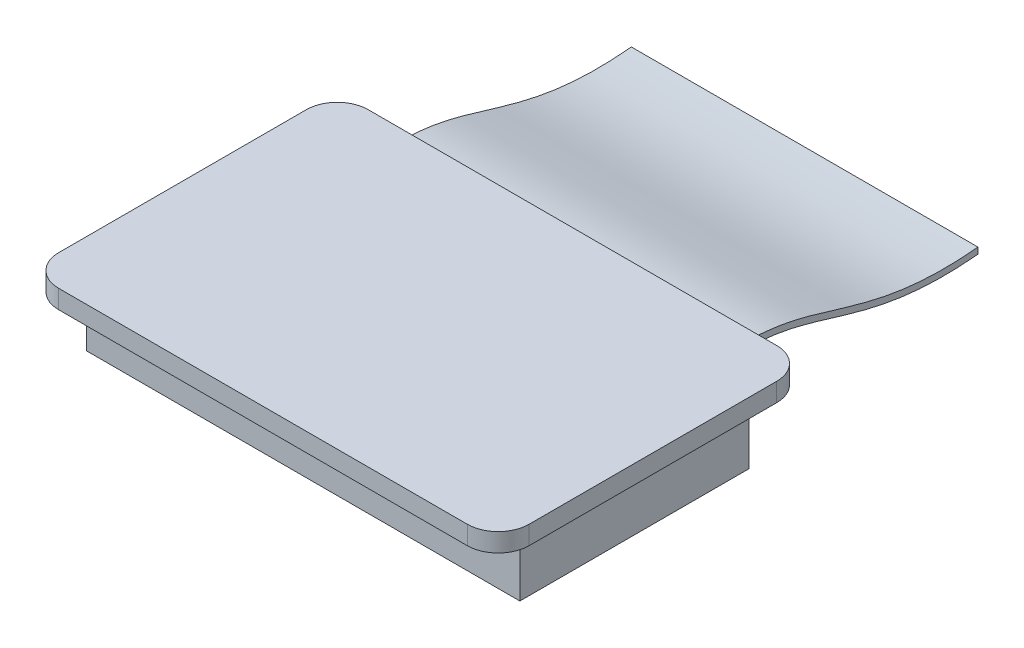
ISO-10303-21;
HEADER;
FILE_DESCRIPTION(('STEP AP214'),'2;1');
FILE_NAME('part.step','',(''),(''),'','','');
FILE_SCHEMA(('AUTOMOTIVE_DESIGN { 1 0 10303 214 1 1 1 1 }'));
ENDSEC;
DATA;
#1=APPLICATION_CONTEXT('core data for automotive mechanical design processes');
#2=APPLICATION_PROTOCOL_DEFINITION('international standard','automotive_design',2000,#1);
#3=PRODUCT_CONTEXT('',#1,'mechanical');
#4=PRODUCT('Part','Part','',(#3));
#5=PRODUCT_RELATED_PRODUCT_CATEGORY('part','',(#4));
#6=PRODUCT_DEFINITION_FORMATION('','',#4);
#7=PRODUCT_DEFINITION_CONTEXT('part definition',#1,'design');
#8=PRODUCT_DEFINITION('design','',#6,#7);
#9=PRODUCT_DEFINITION_SHAPE('','',#8);
#10=(LENGTH_UNIT() NAMED_UNIT(*) SI_UNIT(.MILLI.,.METRE.));
#11=(NAMED_UNIT(*) PLANE_ANGLE_UNIT() SI_UNIT($,.RADIAN.));
#12=(NAMED_UNIT(*) SI_UNIT($,.STERADIAN.) SOLID_ANGLE_UNIT());
#13=UNCERTAINTY_MEASURE_WITH_UNIT(LENGTH_MEASURE(1.E-05),#10,'distance_accuracy_value','');
#14=(GEOMETRIC_REPRESENTATION_CONTEXT(3) GLOBAL_UNCERTAINTY_ASSIGNED_CONTEXT((#13)) GLOBAL_UNIT_ASSIGNED_CONTEXT((#10,
#11,#12)) REPRESENTATION_CONTEXT('',''));
#15=CARTESIAN_POINT('',(0.,0.,0.));
#16=DIRECTION('',(0.,0.,1.));
#17=DIRECTION('',(1.,0.,0.));
#18=AXIS2_PLACEMENT_3D('',#15,#16,#17);
#19=CARTESIAN_POINT('',(3.3,0.748301222298696,8.25169585037883));
#20=DIRECTION('',(0.,-1.,0.));
#21=DIRECTION('',(0.,0.,-1.));
#22=AXIS2_PLACEMENT_3D('',#19,#20,#21);
#23=CYLINDRICAL_SURFACE('',#22,0.5);
#24=CARTESIAN_POINT('',(3.3,0.448301222298696,8.25169585037883));
#25=DIRECTION('',(0.,-1.,0.));
#26=DIRECTION('',(0.,0.,-1.));
#27=AXIS2_PLACEMENT_3D('',#24,#25,#26);
#28=CIRCLE('',#27,0.5);
#29=CARTESIAN_POINT('',(3.3,0.448301222298696,7.75169585037883));
#30=VERTEX_POINT('',#29);
#31=CARTESIAN_POINT('',(3.8,0.448301222298696,8.25169585037883));
#32=VERTEX_POINT('',#31);
#33=EDGE_CURVE('E176',#30,#32,#28,.T.);
#34=ORIENTED_EDGE('',*,*,#33,.F.);
#35=DIRECTION('',(0.,-1.,0.));
#36=VECTOR('',#35,1.);
#37=CARTESIAN_POINT('',(3.3,0.748301222298696,7.75169585037883));
#38=LINE('',#37,#36);
#39=CARTESIAN_POINT('',(3.3,0.748301222298696,7.75169585037883));
#40=VERTEX_POINT('',#39);
#41=EDGE_CURVE('E13',#40,#30,#38,.T.);
#42=ORIENTED_EDGE('',*,*,#41,.F.);
#43=CARTESIAN_POINT('',(3.3,0.748301222298696,8.25169585037883));
#44=DIRECTION('',(0.,-1.,0.));
#45=DIRECTION('',(0.,0.,-1.));
#46=AXIS2_PLACEMENT_3D('',#43,#44,#45);
#47=CIRCLE('',#46,0.5);
#48=CARTESIAN_POINT('',(3.8,0.748301222298696,8.25169585037883));
#49=VERTEX_POINT('',#48);
#50=EDGE_CURVE('E197',#40,#49,#47,.T.);
#51=ORIENTED_EDGE('',*,*,#50,.T.);
#52=DIRECTION('',(0.,-1.,0.));
#53=VECTOR('',#52,1.);
#54=CARTESIAN_POINT('',(3.8,0.748301222298696,8.25169585037883));
#55=LINE('',#54,#53);
#56=EDGE_CURVE('E69',#49,#32,#55,.T.);
#57=ORIENTED_EDGE('',*,*,#56,.T.);
#58=EDGE_LOOP('',(#34,#42,#51,#57));
#59=FACE_BOUND('',#58,.T.);
#60=ADVANCED_FACE('F66',(#59),#23,.T.);
#61=CARTESIAN_POINT('',(-3.3,0.748301222298696,7.75169585037883));
#62=DIRECTION('',(0.,0.,-1.));
#63=DIRECTION('',(-1.,0.,0.));
#64=AXIS2_PLACEMENT_3D('',#61,#62,#63);
#65=PLANE('',#64);
#66=DIRECTION('',(1.,0.,0.));
#67=VECTOR('',#66,1.);
#68=CARTESIAN_POINT('',(-3.3,0.448301222298696,7.75169585037883));
#69=LINE('',#68,#67);
#70=CARTESIAN_POINT('',(-3.3,0.448301222298696,7.75169585037883));
#71=VERTEX_POINT('',#70);
#72=EDGE_CURVE('E195',#71,#30,#69,.T.);
#73=ORIENTED_EDGE('',*,*,#72,.F.);
#74=DIRECTION('',(0.,-1.,0.));
#75=VECTOR('',#74,1.);
#76=CARTESIAN_POINT('',(-3.3,0.748301222298696,7.75169585037883));
#77=LINE('',#76,#75);
#78=CARTESIAN_POINT('',(-3.3,0.748301222298696,7.75169585037883));
#79=VERTEX_POINT('',#78);
#80=EDGE_CURVE('E74',#79,#71,#77,.T.);
#81=ORIENTED_EDGE('',*,*,#80,.F.);
#82=DIRECTION('',(1.,0.,0.));
#83=VECTOR('',#82,1.);
#84=CARTESIAN_POINT('',(-3.3,0.748301222298696,7.75169585037883));
#85=LINE('',#84,#83);
#86=EDGE_CURVE('E166',#79,#40,#85,.T.);
#87=ORIENTED_EDGE('',*,*,#86,.T.);
#88=ORIENTED_EDGE('',*,*,#41,.T.);
#89=EDGE_LOOP('',(#73,#81,#87,#88));
#90=FACE_BOUND('',#89,.T.);
#91=ADVANCED_FACE('F209',(#90),#65,.T.);
#92=CARTESIAN_POINT('',(-3.3,0.748301222298696,8.25169585037883));
#93=DIRECTION('',(0.,-1.,0.));
#94=DIRECTION('',(0.,0.,-1.));
#95=AXIS2_PLACEMENT_3D('',#92,#93,#94);
#96=CYLINDRICAL_SURFACE('',#95,0.5);
#97=CARTESIAN_POINT('',(-3.3,0.448301222298696,8.25169585037883));
#98=DIRECTION('',(0.,-1.,0.));
#99=DIRECTION('',(0.,0.,-1.));
#100=AXIS2_PLACEMENT_3D('',#97,#98,#99);
#101=CIRCLE('',#100,0.5);
#102=CARTESIAN_POINT('',(-3.8,0.448301222298696,8.25169585037883));
#103=VERTEX_POINT('',#102);
#104=EDGE_CURVE('E153',#103,#71,#101,.T.);
#105=ORIENTED_EDGE('',*,*,#104,.F.);
#106=DIRECTION('',(0.,-1.,0.));
#107=VECTOR('',#106,1.);
#108=CARTESIAN_POINT('',(-3.8,0.748301222298696,8.25169585037883));
#109=LINE('',#108,#107);
#110=CARTESIAN_POINT('',(-3.8,0.748301222298696,8.25169585037883));
#111=VERTEX_POINT('',#110);
#112=EDGE_CURVE('E147',#111,#103,#109,.T.);
#113=ORIENTED_EDGE('',*,*,#112,.F.);
#114=CARTESIAN_POINT('',(-3.3,0.748301222298696,8.25169585037883));
#115=DIRECTION('',(0.,-1.,0.));
#116=DIRECTION('',(0.,0.,-1.));
#117=AXIS2_PLACEMENT_3D('',#114,#115,#116);
#118=CIRCLE('',#117,0.5);
#119=EDGE_CURVE('E150',#111,#79,#118,.T.);
#120=ORIENTED_EDGE('',*,*,#119,.T.);
#121=ORIENTED_EDGE('',*,*,#80,.T.);
#122=EDGE_LOOP('',(#105,#113,#120,#121));
#123=FACE_BOUND('',#122,.T.);
#124=ADVANCED_FACE('F149',(#123),#96,.T.);
#125=CARTESIAN_POINT('',(-3.8,0.748301222298696,12.2516958503788));
#126=DIRECTION('',(-1.,0.,0.));
#127=DIRECTION('',(0.,0.,1.));
#128=AXIS2_PLACEMENT_3D('',#125,#126,#127);
#129=PLANE('',#128);
#130=DIRECTION('',(0.,0.,-1.));
#131=VECTOR('',#130,1.);
#132=CARTESIAN_POINT('',(-3.8,0.448301222298696,12.2516958503788));
#133=LINE('',#132,#131);
#134=CARTESIAN_POINT('',(-3.8,0.448301222298696,12.2516958503788));
#135=VERTEX_POINT('',#134);
#136=EDGE_CURVE('E192',#135,#103,#133,.T.);
#137=ORIENTED_EDGE('',*,*,#136,.F.);
#138=DIRECTION('',(0.,-1.,0.));
#139=VECTOR('',#138,1.);
#140=CARTESIAN_POINT('',(-3.8,0.748301222298696,12.2516958503788));
#141=LINE('',#140,#139);
#142=CARTESIAN_POINT('',(-3.8,0.748301222298696,12.2516958503788));
#143=VERTEX_POINT('',#142);
#144=EDGE_CURVE('E158',#143,#135,#141,.T.);
#145=ORIENTED_EDGE('',*,*,#144,.F.);
#146=DIRECTION('',(0.,0.,-1.));
#147=VECTOR('',#146,1.);
#148=CARTESIAN_POINT('',(-3.8,0.748301222298696,12.2516958503788));
#149=LINE('',#148,#147);
#150=EDGE_CURVE('E164',#143,#111,#149,.T.);
#151=ORIENTED_EDGE('',*,*,#150,.T.);
#152=ORIENTED_EDGE('',*,*,#112,.T.);
#153=EDGE_LOOP('',(#137,#145,#151,#152));
#154=FACE_BOUND('',#153,.T.);
#155=ADVANCED_FACE('F168',(#154),#129,.T.);
#156=CARTESIAN_POINT('',(-3.3,0.748301222298696,12.2516958503788));
#157=DIRECTION('',(0.,-1.,0.));
#158=DIRECTION('',(0.,0.,-1.));
#159=AXIS2_PLACEMENT_3D('',#156,#157,#158);
#160=CYLINDRICAL_SURFACE('',#159,0.5);
#161=CARTESIAN_POINT('',(-3.3,0.448301222298696,12.2516958503788));
#162=DIRECTION('',(0.,-1.,0.));
#163=DIRECTION('',(0.,0.,-1.));
#164=AXIS2_PLACEMENT_3D('',#161,#162,#163);
#165=CIRCLE('',#164,0.5);
#166=CARTESIAN_POINT('',(-3.3,0.448301222298696,12.7516958503788));
#167=VERTEX_POINT('',#166);
#168=EDGE_CURVE('E189',#167,#135,#165,.T.);
#169=ORIENTED_EDGE('',*,*,#168,.F.);
#170=DIRECTION('',(0.,-1.,0.));
#171=VECTOR('',#170,1.);
#172=CARTESIAN_POINT('',(-3.3,0.748301222298696,12.7516958503788));
#173=LINE('',#172,#171);
#174=CARTESIAN_POINT('',(-3.3,0.748301222298696,12.7516958503788));
#175=VERTEX_POINT('',#174);
#176=EDGE_CURVE('E201',#175,#167,#173,.T.);
#177=ORIENTED_EDGE('',*,*,#176,.F.);
#178=CARTESIAN_POINT('',(-3.3,0.748301222298696,12.2516958503788));
#179=DIRECTION('',(0.,-1.,0.));
#180=DIRECTION('',(0.,0.,-1.));
#181=AXIS2_PLACEMENT_3D('',#178,#179,#180);
#182=CIRCLE('',#181,0.5);
#183=EDGE_CURVE('E169',#175,#143,#182,.T.);
#184=ORIENTED_EDGE('',*,*,#183,.T.);
#185=ORIENTED_EDGE('',*,*,#144,.T.);
#186=EDGE_LOOP('',(#169,#177,#184,#185));
#187=FACE_BOUND('',#186,.T.);
#188=ADVANCED_FACE('F222',(#187),#160,.T.);
#189=CARTESIAN_POINT('',(-3.3,0.748301222298696,12.7516958503788));
#190=DIRECTION('',(0.,0.,1.));
#191=DIRECTION('',(1.,0.,0.));
#192=AXIS2_PLACEMENT_3D('',#189,#190,#191);
#193=PLANE('',#192);
#194=DIRECTION('',(-1.,0.,0.));
#195=VECTOR('',#194,1.);
#196=CARTESIAN_POINT('',(-3.3,0.448301222298696,12.7516958503788));
#197=LINE('',#196,#195);
#198=CARTESIAN_POINT('',(3.3,0.448301222298696,12.7516958503788));
#199=VERTEX_POINT('',#198);
#200=EDGE_CURVE('E186',#199,#167,#197,.T.);
#201=ORIENTED_EDGE('',*,*,#200,.F.);
#202=DIRECTION('',(0.,-1.,0.));
#203=VECTOR('',#202,1.);
#204=CARTESIAN_POINT('',(3.3,0.748301222298696,12.7516958503788));
#205=LINE('',#204,#203);
#206=CARTESIAN_POINT('',(3.3,0.748301222298696,12.7516958503788));
#207=VERTEX_POINT('',#206);
#208=EDGE_CURVE('E203',#207,#199,#205,.T.);
#209=ORIENTED_EDGE('',*,*,#208,.F.);
#210=DIRECTION('',(-1.,0.,0.));
#211=VECTOR('',#210,1.);
#212=CARTESIAN_POINT('',(-3.3,0.748301222298696,12.7516958503788));
#213=LINE('',#212,#211);
#214=EDGE_CURVE('E171',#207,#175,#213,.T.);
#215=ORIENTED_EDGE('',*,*,#214,.T.);
#216=ORIENTED_EDGE('',*,*,#176,.T.);
#217=EDGE_LOOP('',(#201,#209,#215,#216));
#218=FACE_BOUND('',#217,.T.);
#219=ADVANCED_FACE('F225',(#218),#193,.T.);
#220=CARTESIAN_POINT('',(3.3,0.748301222298696,12.2516958503788));
#221=DIRECTION('',(0.,-1.,0.));
#222=DIRECTION('',(0.,0.,-1.));
#223=AXIS2_PLACEMENT_3D('',#220,#221,#222);
#224=CYLINDRICAL_SURFACE('',#223,0.5);
#225=CARTESIAN_POINT('',(3.3,0.448301222298696,12.2516958503788));
#226=DIRECTION('',(0.,-1.,0.));
#227=DIRECTION('',(0.,0.,1.));
#228=AXIS2_PLACEMENT_3D('',#225,#226,#227);
#229=CIRCLE('',#228,0.5);
#230=CARTESIAN_POINT('',(3.8,0.448301222298696,12.2516958503788));
#231=VERTEX_POINT('',#230);
#232=EDGE_CURVE('E183',#231,#199,#229,.T.);
#233=ORIENTED_EDGE('',*,*,#232,.F.);
#234=DIRECTION('',(0.,-1.,0.));
#235=VECTOR('',#234,1.);
#236=CARTESIAN_POINT('',(3.8,0.748301222298696,12.2516958503788));
#237=LINE('',#236,#235);
#238=CARTESIAN_POINT('',(3.8,0.748301222298696,12.2516958503788));
#239=VERTEX_POINT('',#238);
#240=EDGE_CURVE('E204',#239,#231,#237,.T.);
#241=ORIENTED_EDGE('',*,*,#240,.F.);
#242=CARTESIAN_POINT('',(3.3,0.748301222298696,12.2516958503788));
#243=DIRECTION('',(0.,-1.,0.));
#244=DIRECTION('',(0.,0.,1.));
#245=AXIS2_PLACEMENT_3D('',#242,#243,#244);
#246=CIRCLE('',#245,0.5);
#247=EDGE_CURVE('E293',#239,#207,#246,.T.);
#248=ORIENTED_EDGE('',*,*,#247,.T.);
#249=ORIENTED_EDGE('',*,*,#208,.T.);
#250=EDGE_LOOP('',(#233,#241,#248,#249));
#251=FACE_BOUND('',#250,.T.);
#252=ADVANCED_FACE('F229',(#251),#224,.T.);
#253=CARTESIAN_POINT('',(3.8,0.748301222298696,12.2516958503788));
#254=DIRECTION('',(1.,0.,0.));
#255=DIRECTION('',(0.,0.,-1.));
#256=AXIS2_PLACEMENT_3D('',#253,#254,#255);
#257=PLANE('',#256);
#258=DIRECTION('',(0.,0.,1.));
#259=VECTOR('',#258,1.);
#260=CARTESIAN_POINT('',(3.8,0.448301222298696,12.2516958503788));
#261=LINE('',#260,#259);
#262=EDGE_CURVE('E179',#32,#231,#261,.T.);
#263=ORIENTED_EDGE('',*,*,#262,.F.);
#264=ORIENTED_EDGE('',*,*,#56,.F.);
#265=DIRECTION('',(0.,0.,1.));
#266=VECTOR('',#265,1.);
#267=CARTESIAN_POINT('',(3.8,0.748301222298696,12.2516958503788));
#268=LINE('',#267,#266);
#269=EDGE_CURVE('E291',#49,#239,#268,.T.);
#270=ORIENTED_EDGE('',*,*,#269,.T.);
#271=ORIENTED_EDGE('',*,*,#240,.T.);
#272=EDGE_LOOP('',(#263,#264,#270,#271));
#273=FACE_BOUND('',#272,.T.);
#274=ADVANCED_FACE('F206',(#273),#257,.T.);
#275=CARTESIAN_POINT('',(3.3,0.748301222298696,8.25169585037883));
#276=DIRECTION('',(0.,-1.,0.));
#277=DIRECTION('',(0.,0.,-1.));
#278=AXIS2_PLACEMENT_3D('',#275,#276,#277);
#279=PLANE('',#278);
#280=ORIENTED_EDGE('',*,*,#50,.F.);
#281=ORIENTED_EDGE('',*,*,#86,.F.);
#282=ORIENTED_EDGE('',*,*,#119,.F.);
#283=ORIENTED_EDGE('',*,*,#150,.F.);
#284=ORIENTED_EDGE('',*,*,#183,.F.);
#285=ORIENTED_EDGE('',*,*,#214,.F.);
#286=ORIENTED_EDGE('',*,*,#247,.F.);
#287=ORIENTED_EDGE('',*,*,#269,.F.);
#288=EDGE_LOOP('',(#280,#281,#282,#283,#284,#285,#286,#287));
#289=FACE_BOUND('',#288,.T.);
#290=ADVANCED_FACE('F162',(#289),#279,.F.);
#291=CARTESIAN_POINT('',(3.3,0.448301222298696,8.25169585037883));
#292=DIRECTION('',(0.,-1.,0.));
#293=DIRECTION('',(0.,0.,-1.));
#294=AXIS2_PLACEMENT_3D('',#291,#292,#293);
#295=PLANE('',#294);
#296=DIRECTION('',(0.,0.,1.));
#297=VECTOR('',#296,1.);
#298=CARTESIAN_POINT('',(3.5,0.448301222298696,12.1016958503788));
#299=LINE('',#298,#297);
#300=CARTESIAN_POINT('',(3.5,0.448301222298696,8.40169585037883));
#301=VERTEX_POINT('',#300);
#302=CARTESIAN_POINT('',(3.5,0.448301222298696,12.1016958503788));
#303=VERTEX_POINT('',#302);
#304=EDGE_CURVE('E275',#301,#303,#299,.T.);
#305=ORIENTED_EDGE('',*,*,#304,.F.);
#306=DIRECTION('',(-1.,0.,0.));
#307=VECTOR('',#306,1.);
#308=CARTESIAN_POINT('',(3.5,0.448301222298696,8.40169585037883));
#309=LINE('',#308,#307);
#310=CARTESIAN_POINT('',(-3.5,0.448301222298696,8.40169585037883));
#311=VERTEX_POINT('',#310);
#312=EDGE_CURVE('E286',#301,#311,#309,.T.);
#313=ORIENTED_EDGE('',*,*,#312,.T.);
#314=DIRECTION('',(0.,0.,1.));
#315=VECTOR('',#314,1.);
#316=CARTESIAN_POINT('',(-3.5,0.448301222298696,12.1016958503788));
#317=LINE('',#316,#315);
#318=CARTESIAN_POINT('',(-3.5,0.448301222298696,12.1016958503788));
#319=VERTEX_POINT('',#318);
#320=EDGE_CURVE('E278',#311,#319,#317,.T.);
#321=ORIENTED_EDGE('',*,*,#320,.T.);
#322=DIRECTION('',(-1.,0.,0.));
#323=VECTOR('',#322,1.);
#324=CARTESIAN_POINT('',(3.5,0.448301222298696,12.1016958503788));
#325=LINE('',#324,#323);
#326=EDGE_CURVE('E302',#303,#319,#325,.T.);
#327=ORIENTED_EDGE('',*,*,#326,.F.);
#328=EDGE_LOOP('',(#305,#313,#321,#327));
#329=FACE_BOUND('',#328,.T.);
#330=ORIENTED_EDGE('',*,*,#33,.T.);
#331=ORIENTED_EDGE('',*,*,#262,.T.);
#332=ORIENTED_EDGE('',*,*,#232,.T.);
#333=ORIENTED_EDGE('',*,*,#200,.T.);
#334=ORIENTED_EDGE('',*,*,#168,.T.);
#335=ORIENTED_EDGE('',*,*,#136,.T.);
#336=ORIENTED_EDGE('',*,*,#104,.T.);
#337=ORIENTED_EDGE('',*,*,#72,.T.);
#338=EDGE_LOOP('',(#330,#331,#332,#333,#334,#335,#336,#337));
#339=FACE_BOUND('',#338,.T.);
#340=ADVANCED_FACE('F208',(#329,#339),#295,.T.);
#341=CARTESIAN_POINT('',(3.5,0.448301222298696,12.1016958503788));
#342=DIRECTION('',(0.,0.,-1.));
#343=DIRECTION('',(-1.,0.,0.));
#344=AXIS2_PLACEMENT_3D('',#341,#342,#343);
#345=PLANE('',#344);
#346=DIRECTION('',(0.,-1.,0.));
#347=VECTOR('',#346,1.);
#348=CARTESIAN_POINT('',(-3.5,0.448301222298696,12.1016958503788));
#349=LINE('',#348,#347);
#350=CARTESIAN_POINT('',(-3.5,-0.551698777701304,12.1016958503788));
#351=VERTEX_POINT('',#350);
#352=EDGE_CURVE('E82',#319,#351,#349,.T.);
#353=ORIENTED_EDGE('',*,*,#352,.T.);
#354=DIRECTION('',(-1.,0.,0.));
#355=VECTOR('',#354,1.);
#356=CARTESIAN_POINT('',(3.5,-0.551698777701304,12.1016958503788));
#357=LINE('',#356,#355);
#358=CARTESIAN_POINT('',(3.5,-0.551698777701304,12.1016958503788));
#359=VERTEX_POINT('',#358);
#360=EDGE_CURVE('E180',#359,#351,#357,.T.);
#361=ORIENTED_EDGE('',*,*,#360,.F.);
#362=DIRECTION('',(0.,-1.,0.));
#363=VECTOR('',#362,1.);
#364=CARTESIAN_POINT('',(3.5,0.448301222298696,12.1016958503788));
#365=LINE('',#364,#363);
#366=EDGE_CURVE('E267',#303,#359,#365,.T.);
#367=ORIENTED_EDGE('',*,*,#366,.F.);
#368=ORIENTED_EDGE('',*,*,#326,.T.);
#369=EDGE_LOOP('',(#353,#361,#367,#368));
#370=FACE_BOUND('',#369,.T.);
#371=ADVANCED_FACE('F240',(#370),#345,.F.);
#372=CARTESIAN_POINT('',(3.5,-0.551698777701304,12.1016958503788));
#373=DIRECTION('',(0.,1.,0.));
#374=DIRECTION('',(0.,0.,1.));
#375=AXIS2_PLACEMENT_3D('',#372,#373,#374);
#376=PLANE('',#375);
#377=DIRECTION('',(0.,0.,-1.));
#378=VECTOR('',#377,1.);
#379=CARTESIAN_POINT('',(-3.5,-0.551698777701304,12.1016958503788));
#380=LINE('',#379,#378);
#381=CARTESIAN_POINT('',(-3.5,-0.551698777701304,8.40169585037883));
#382=VERTEX_POINT('',#381);
#383=EDGE_CURVE('E309',#351,#382,#380,.T.);
#384=ORIENTED_EDGE('',*,*,#383,.T.);
#385=DIRECTION('',(-1.,0.,0.));
#386=VECTOR('',#385,1.);
#387=CARTESIAN_POINT('',(3.5,-0.551698777701304,8.40169585037883));
#388=LINE('',#387,#386);
#389=CARTESIAN_POINT('',(3.5,-0.551698777701304,8.40169585037883));
#390=VERTEX_POINT('',#389);
#391=EDGE_CURVE('E283',#390,#382,#388,.T.);
#392=ORIENTED_EDGE('',*,*,#391,.F.);
#393=DIRECTION('',(0.,0.,-1.));
#394=VECTOR('',#393,1.);
#395=CARTESIAN_POINT('',(3.5,-0.551698777701304,12.1016958503788));
#396=LINE('',#395,#394);
#397=EDGE_CURVE('E272',#359,#390,#396,.T.);
#398=ORIENTED_EDGE('',*,*,#397,.F.);
#399=ORIENTED_EDGE('',*,*,#360,.T.);
#400=EDGE_LOOP('',(#384,#392,#398,#399));
#401=FACE_BOUND('',#400,.T.);
#402=ADVANCED_FACE('F245',(#401),#376,.F.);
#403=CARTESIAN_POINT('',(3.5,0.448301222298696,8.40169585037883));
#404=DIRECTION('',(0.,0.,1.));
#405=DIRECTION('',(1.,0.,0.));
#406=AXIS2_PLACEMENT_3D('',#403,#404,#405);
#407=PLANE('',#406);
#408=DIRECTION('',(0.,1.,0.));
#409=VECTOR('',#408,1.);
#410=CARTESIAN_POINT('',(-3.5,0.448301222298696,8.40169585037883));
#411=LINE('',#410,#409);
#412=EDGE_CURVE('E306',#382,#311,#411,.T.);
#413=ORIENTED_EDGE('',*,*,#412,.T.);
#414=ORIENTED_EDGE('',*,*,#312,.F.);
#415=DIRECTION('',(0.,1.,0.));
#416=VECTOR('',#415,1.);
#417=CARTESIAN_POINT('',(3.5,0.448301222298696,8.40169585037883));
#418=LINE('',#417,#416);
#419=EDGE_CURVE('E313',#390,#301,#418,.T.);
#420=ORIENTED_EDGE('',*,*,#419,.F.);
#421=ORIENTED_EDGE('',*,*,#391,.T.);
#422=EDGE_LOOP('',(#413,#414,#420,#421));
#423=FACE_BOUND('',#422,.T.);
#424=ADVANCED_FACE('F249',(#423),#407,.F.);
#425=CARTESIAN_POINT('',(3.5,0.,0.));
#426=DIRECTION('',(1.,0.,0.));
#427=DIRECTION('',(0.,0.,-1.));
#428=AXIS2_PLACEMENT_3D('',#425,#426,#427);
#429=PLANE('',#428);
#430=ORIENTED_EDGE('',*,*,#366,.T.);
#431=ORIENTED_EDGE('',*,*,#397,.T.);
#432=ORIENTED_EDGE('',*,*,#419,.T.);
#433=ORIENTED_EDGE('',*,*,#304,.T.);
#434=EDGE_LOOP('',(#430,#431,#432,#433));
#435=FACE_BOUND('',#434,.T.);
#436=ADVANCED_FACE('F253',(#435),#429,.T.);
#437=CARTESIAN_POINT('',(-3.5,0.,0.));
#438=DIRECTION('',(1.,0.,0.));
#439=DIRECTION('',(0.,0.,-1.));
#440=AXIS2_PLACEMENT_3D('',#437,#438,#439);
#441=PLANE('',#440);
#442=ORIENTED_EDGE('',*,*,#352,.F.);
#443=ORIENTED_EDGE('',*,*,#320,.F.);
#444=ORIENTED_EDGE('',*,*,#412,.F.);
#445=ORIENTED_EDGE('',*,*,#383,.F.);
#446=EDGE_LOOP('',(#442,#443,#444,#445));
#447=FACE_BOUND('',#446,.T.);
#448=ADVANCED_FACE('F255',(#447),#441,.F.);
#449=CLOSED_SHELL('',(#60,#91,#124,#155,#188,#219,#252,#274,#290,#340,#371,#402,#424,#436,#448));
#450=MANIFOLD_SOLID_BREP('B2',#449);
#451=CARTESIAN_POINT('',(0.,0.547843022465263,7.7421339457778));
#452=DIRECTION('',(0.,0.0956190460103406,0.995418001665669));
#453=DIRECTION('',(1.,0.,0.));
#454=AXIS2_PLACEMENT_3D('',#451,#452,#453);
#455=PLANE('',#454);
#456=DIRECTION('',(0.,-0.995418001665668,0.0956190460103406));
#457=VECTOR('',#456,1.);
#458=CARTESIAN_POINT('',(-2.8,0.547843022465263,7.7421339457778));
#459=LINE('',#458,#457);
#460=CARTESIAN_POINT('',(-2.8,0.547843022465263,7.7421339457778));
#461=VERTEX_POINT('',#460);
#462=CARTESIAN_POINT('',(-2.8,0.448301222298696,7.75169585037883));
#463=VERTEX_POINT('',#462);
#464=EDGE_CURVE('E457',#461,#463,#459,.T.);
#465=ORIENTED_EDGE('',*,*,#464,.T.);
#466=DIRECTION('',(1.,0.,0.));
#467=VECTOR('',#466,1.);
#468=CARTESIAN_POINT('',(-2.8,0.448301222298696,7.75169585037883));
#469=LINE('',#468,#467);
#470=CARTESIAN_POINT('',(2.8,0.448301222298696,7.75169585037883));
#471=VERTEX_POINT('',#470);
#472=EDGE_CURVE('E463',#463,#471,#469,.T.);
#473=ORIENTED_EDGE('',*,*,#472,.T.);
#474=DIRECTION('',(0.,0.995418001665668,-0.0956190460103407));
#475=VECTOR('',#474,1.);
#476=CARTESIAN_POINT('',(2.8,0.547843022465264,7.7421339457778));
#477=LINE('',#476,#475);
#478=CARTESIAN_POINT('',(2.8,0.547843022465264,7.7421339457778));
#479=VERTEX_POINT('',#478);
#480=EDGE_CURVE('E458',#471,#479,#477,.T.);
#481=ORIENTED_EDGE('',*,*,#480,.T.);
#482=DIRECTION('',(-1.,0.,0.));
#483=VECTOR('',#482,1.);
#484=CARTESIAN_POINT('',(-2.8,0.547843022465263,7.7421339457778));
#485=LINE('',#484,#483);
#486=EDGE_CURVE('E418',#479,#461,#485,.T.);
#487=ORIENTED_EDGE('',*,*,#486,.T.);
#488=EDGE_LOOP('',(#465,#473,#481,#487));
#489=FACE_BOUND('',#488,.T.);
#490=ADVANCED_FACE('F414',(#489),#455,.T.);
#491=CARTESIAN_POINT('',(0.,0.,3.99999999999998));
#492=DIRECTION('',(0.,0.,1.));
#493=DIRECTION('',(1.,0.,0.));
#494=AXIS2_PLACEMENT_3D('',#491,#492,#493);
#495=PLANE('',#494);
#496=DIRECTION('',(0.,-1.,0.));
#497=VECTOR('',#496,1.);
#498=CARTESIAN_POINT('',(-2.8,0.,3.99999999999998));
#499=LINE('',#498,#497);
#500=CARTESIAN_POINT('',(-2.8,0.,3.99999999999998));
#501=VERTEX_POINT('',#500);
#502=CARTESIAN_POINT('',(-2.8,-0.0999999999999998,3.99999999999998));
#503=VERTEX_POINT('',#502);
#504=EDGE_CURVE('E467',#501,#503,#499,.T.);
#505=ORIENTED_EDGE('',*,*,#504,.F.);
#506=DIRECTION('',(-1.,0.,0.));
#507=VECTOR('',#506,1.);
#508=CARTESIAN_POINT('',(-2.8,0.,3.99999999999998));
#509=LINE('',#508,#507);
#510=CARTESIAN_POINT('',(2.8,0.,3.99999999999998));
#511=VERTEX_POINT('',#510);
#512=EDGE_CURVE('E64',#511,#501,#509,.T.);
#513=ORIENTED_EDGE('',*,*,#512,.F.);
#514=DIRECTION('',(0.,1.,0.));
#515=VECTOR('',#514,1.);
#516=CARTESIAN_POINT('',(2.8,0.,3.99999999999998));
#517=LINE('',#516,#515);
#518=CARTESIAN_POINT('',(2.8,-0.0999999999999998,3.99999999999998));
#519=VERTEX_POINT('',#518);
#520=EDGE_CURVE('E424',#519,#511,#517,.T.);
#521=ORIENTED_EDGE('',*,*,#520,.F.);
#522=DIRECTION('',(1.,0.,0.));
#523=VECTOR('',#522,1.);
#524=CARTESIAN_POINT('',(-2.8,-0.0999999999999998,3.99999999999998));
#525=LINE('',#524,#523);
#526=EDGE_CURVE('E469',#503,#519,#525,.T.);
#527=ORIENTED_EDGE('',*,*,#526,.F.);
#528=EDGE_LOOP('',(#505,#513,#521,#527));
#529=FACE_BOUND('',#528,.T.);
#530=ADVANCED_FACE('F507',(#529),#495,.F.);
#531=CARTESIAN_POINT('',(2.8,0.,3.99999999999998));
#532=CARTESIAN_POINT('',(2.8,-0.024628468128532,4.25638846601688));
#533=CARTESIAN_POINT('',(2.8,-0.0386180157529813,4.72259081002346));
#534=CARTESIAN_POINT('',(2.8,0.0194715301087125,5.3120111853385));
#535=CARTESIAN_POINT('',(2.8,0.129906644668738,5.82138904334296));
#536=CARTESIAN_POINT('',(2.8,0.291873769263778,6.3680270958267));
#537=CARTESIAN_POINT('',(2.8,0.477782991355757,6.96597559310497));
#538=CARTESIAN_POINT('',(2.8,0.547843022465264,7.46326880544397));
#539=CARTESIAN_POINT('',(2.8,0.547843022465264,7.74213394577779));
#540=CARTESIAN_POINT('',(-2.8,0.,3.99999999999998));
#541=CARTESIAN_POINT('',(-2.8,-0.0246284681285331,4.25638846601688));
#542=CARTESIAN_POINT('',(-2.8,-0.0386180157529824,4.72259081002346));
#543=CARTESIAN_POINT('',(-2.8,0.0194715301087115,5.3120111853385));
#544=CARTESIAN_POINT('',(-2.8,0.129906644668737,5.82138904334296));
#545=CARTESIAN_POINT('',(-2.8,0.291873769263777,6.3680270958267));
#546=CARTESIAN_POINT('',(-2.8,0.477782991355756,6.96597559310497));
#547=CARTESIAN_POINT('',(-2.8,0.547843022465263,7.46326880544397));
#548=CARTESIAN_POINT('',(-2.8,0.547843022465263,7.74213394577779));
#549=B_SPLINE_SURFACE_WITH_KNOTS('',1,3,((#531,#532,#533,#534,#535,#536,#537,#538,#539),(#540,
#541,#542,#543,#544,#545,#546,#547,#548)),.UNSPECIFIED.,.F.,.F.,.F.,(2,2),(4,1,1,1,1,1,4),
(0.508771929824561,1.),(0.,0.14,0.28,0.42,0.559999999997895,0.780000000000162,1.),.UNSPECIFIED.);
#550=CARTESIAN_POINT('',(-2.8,0.,3.99999999999998));
#551=CARTESIAN_POINT('',(-2.8,-0.0246284681285331,4.25638846601688));
#552=CARTESIAN_POINT('',(-2.8,-0.0386180157529824,4.72259081002346));
#553=CARTESIAN_POINT('',(-2.8,0.0194715301087115,5.3120111853385));
#554=CARTESIAN_POINT('',(-2.8,0.129906644668737,5.82138904334296));
#555=CARTESIAN_POINT('',(-2.8,0.291873769263777,6.3680270958267));
#556=CARTESIAN_POINT('',(-2.8,0.477782991355756,6.96597559310497));
#557=CARTESIAN_POINT('',(-2.8,0.547843022465263,7.46326880544397));
#558=CARTESIAN_POINT('',(-2.8,0.547843022465263,7.74213394577779));
#559=B_SPLINE_CURVE_WITH_KNOTS('',3,(#550,#551,#552,#553,#554,#555,#556,#557,#558),
.UNSPECIFIED.,.F.,.F.,(4,1,1,1,1,1,4),(0.,0.14,0.28,0.42,0.559999999997895,0.780000000000162,
1.),.UNSPECIFIED.);
#560=EDGE_CURVE('E433',#501,#461,#559,.T.);
#561=CARTESIAN_POINT('',(2.8,0.,3.99999999999998));
#562=CARTESIAN_POINT('',(2.8,-0.024628468128532,4.25638846601688));
#563=CARTESIAN_POINT('',(2.8,-0.0386180157529813,4.72259081002346));
#564=CARTESIAN_POINT('',(2.8,0.0194715301087125,5.3120111853385));
#565=CARTESIAN_POINT('',(2.8,0.129906644668738,5.82138904334296));
#566=CARTESIAN_POINT('',(2.8,0.291873769263778,6.3680270958267));
#567=CARTESIAN_POINT('',(2.8,0.477782991355757,6.96597559310497));
#568=CARTESIAN_POINT('',(2.8,0.547843022465264,7.46326880544397));
#569=CARTESIAN_POINT('',(2.8,0.547843022465264,7.74213394577779));
#570=B_SPLINE_CURVE_WITH_KNOTS('',3,(#561,#562,#563,#564,#565,#566,#567,#568,#569),
.UNSPECIFIED.,.F.,.F.,(4,1,1,1,1,1,4),(0.,0.14,0.28,0.42,0.559999999997895,0.780000000000162,
1.),.UNSPECIFIED.);
#571=EDGE_CURVE('E450',#511,#479,#570,.T.);
#572=ORIENTED_EDGE('',*,*,#512,.T.);
#573=ORIENTED_EDGE('',*,*,#560,.T.);
#574=ORIENTED_EDGE('',*,*,#486,.F.);
#575=ORIENTED_EDGE('',*,*,#571,.F.);
#576=EDGE_LOOP('',(#572,#573,#574,#575));
#577=FACE_BOUND('',#576,.T.);
#578=ADVANCED_FACE('F465',(#577),#549,.T.);
#579=CARTESIAN_POINT('',(2.8,-0.0999999999999998,3.99999999999998));
#580=DIRECTION('',(1.,0.,0.));
#581=DIRECTION('',(0.,1.,0.));
#582=AXIS2_PLACEMENT_3D('',#579,#580,#581);
#583=PLANE('',#582);
#584=ORIENTED_EDGE('',*,*,#520,.T.);
#585=ORIENTED_EDGE('',*,*,#571,.T.);
#586=ORIENTED_EDGE('',*,*,#480,.F.);
#587=CARTESIAN_POINT('',(2.8,-0.0999999999999998,3.99999999999998));
#588=CARTESIAN_POINT('',(2.8,-0.124487822602086,4.2605128606233));
#589=CARTESIAN_POINT('',(2.8,-0.13819607917364,4.73496399384273));
#590=CARTESIAN_POINT('',(2.8,-0.0775684463145836,5.33705516657012));
#591=CARTESIAN_POINT('',(2.8,0.0359942616894102,5.85609097163903));
#592=CARTESIAN_POINT('',(2.8,0.200282397231649,6.40790162664091));
#593=CARTESIAN_POINT('',(2.8,0.38279321622902,6.99976726735009));
#594=CARTESIAN_POINT('',(2.8,0.449818563978634,7.48090729992634));
#595=CARTESIAN_POINT('',(2.8,0.448301222298696,7.75169585037883));
#596=B_SPLINE_CURVE_WITH_KNOTS('',3,(#587,#588,#589,#590,#591,#592,#593,#594,#595),
.UNSPECIFIED.,.F.,.F.,(4,1,1,1,1,1,4),(0.,0.14,0.28,0.42,0.559999999997895,0.780000000000162,
1.),.UNSPECIFIED.);
#597=EDGE_CURVE('E471',#519,#471,#596,.T.);
#598=ORIENTED_EDGE('',*,*,#597,.F.);
#599=EDGE_LOOP('',(#584,#585,#586,#598));
#600=FACE_BOUND('',#599,.T.);
#601=ADVANCED_FACE('F503',(#600),#583,.T.);
#602=CARTESIAN_POINT('',(-2.8,-0.0999999999999998,3.99999999999998));
#603=CARTESIAN_POINT('',(-2.8,-0.124487822602086,4.2605128606233));
#604=CARTESIAN_POINT('',(-2.8,-0.13819607917364,4.73496399384273));
#605=CARTESIAN_POINT('',(-2.8,-0.0775684463145836,5.33705516657012));
#606=CARTESIAN_POINT('',(-2.8,0.0359942616894102,5.85609097163903));
#607=CARTESIAN_POINT('',(-2.8,0.200282397231649,6.40790162664091));
#608=CARTESIAN_POINT('',(-2.8,0.38279321622902,6.99976726735009));
#609=CARTESIAN_POINT('',(-2.8,0.449818563978634,7.48090729992634));
#610=CARTESIAN_POINT('',(-2.8,0.448301222298696,7.75169585037883));
#611=CARTESIAN_POINT('',(2.8,-0.0999999999999998,3.99999999999998));
#612=CARTESIAN_POINT('',(2.8,-0.124487822602086,4.2605128606233));
#613=CARTESIAN_POINT('',(2.8,-0.13819607917364,4.73496399384273));
#614=CARTESIAN_POINT('',(2.8,-0.0775684463145836,5.33705516657012));
#615=CARTESIAN_POINT('',(2.8,0.0359942616894102,5.85609097163903));
#616=CARTESIAN_POINT('',(2.8,0.200282397231649,6.40790162664091));
#617=CARTESIAN_POINT('',(2.8,0.38279321622902,6.99976726735009));
#618=CARTESIAN_POINT('',(2.8,0.449818563978634,7.48090729992634));
#619=CARTESIAN_POINT('',(2.8,0.448301222298696,7.75169585037883));
#620=B_SPLINE_SURFACE_WITH_KNOTS('',1,3,((#602,#603,#604,#605,#606,#607,#608,#609,#610),(#611,
#612,#613,#614,#615,#616,#617,#618,#619)),.UNSPECIFIED.,.F.,.F.,.F.,(2,2),(4,1,1,1,1,1,4),
(0.00877192982456138,0.5),(0.,0.14,0.28,0.42,0.559999999997895,0.780000000000162,1.),.UNSPECIFIED.);
#621=CARTESIAN_POINT('',(-2.8,-0.0999999999999998,3.99999999999998));
#622=CARTESIAN_POINT('',(-2.8,-0.124487822602086,4.2605128606233));
#623=CARTESIAN_POINT('',(-2.8,-0.13819607917364,4.73496399384273));
#624=CARTESIAN_POINT('',(-2.8,-0.0775684463145836,5.33705516657012));
#625=CARTESIAN_POINT('',(-2.8,0.0359942616894102,5.85609097163903));
#626=CARTESIAN_POINT('',(-2.8,0.200282397231649,6.40790162664091));
#627=CARTESIAN_POINT('',(-2.8,0.38279321622902,6.99976726735009));
#628=CARTESIAN_POINT('',(-2.8,0.449818563978634,7.48090729992634));
#629=CARTESIAN_POINT('',(-2.8,0.448301222298696,7.75169585037883));
#630=B_SPLINE_CURVE_WITH_KNOTS('',3,(#621,#622,#623,#624,#625,#626,#627,#628,#629),
.UNSPECIFIED.,.F.,.F.,(4,1,1,1,1,1,4),(0.,0.14,0.28,0.42,0.559999999997895,0.780000000000162,
1.),.UNSPECIFIED.);
#631=EDGE_CURVE('E460',#503,#463,#630,.T.);
#632=ORIENTED_EDGE('',*,*,#526,.T.);
#633=ORIENTED_EDGE('',*,*,#597,.T.);
#634=ORIENTED_EDGE('',*,*,#472,.F.);
#635=ORIENTED_EDGE('',*,*,#631,.F.);
#636=EDGE_LOOP('',(#632,#633,#634,#635));
#637=FACE_BOUND('',#636,.T.);
#638=ADVANCED_FACE('F500',(#637),#620,.T.);
#639=CARTESIAN_POINT('',(-2.8,0.,3.99999999999998));
#640=DIRECTION('',(-1.,0.,0.));
#641=DIRECTION('',(0.,-1.,0.));
#642=AXIS2_PLACEMENT_3D('',#639,#640,#641);
#643=PLANE('',#642);
#644=ORIENTED_EDGE('',*,*,#504,.T.);
#645=ORIENTED_EDGE('',*,*,#631,.T.);
#646=ORIENTED_EDGE('',*,*,#464,.F.);
#647=ORIENTED_EDGE('',*,*,#560,.F.);
#648=EDGE_LOOP('',(#644,#645,#646,#647));
#649=FACE_BOUND('',#648,.T.);
#650=ADVANCED_FACE('F416',(#649),#643,.T.);
#651=CLOSED_SHELL('',(#490,#530,#578,#601,#638,#650));
#652=MANIFOLD_SOLID_BREP('B7',#651);
#653=ADVANCED_BREP_SHAPE_REPRESENTATION('',(#18,#450,#652),#14);
#654=SHAPE_DEFINITION_REPRESENTATION(#9,#653);
ENDSEC;
END-ISO-10303-21;
